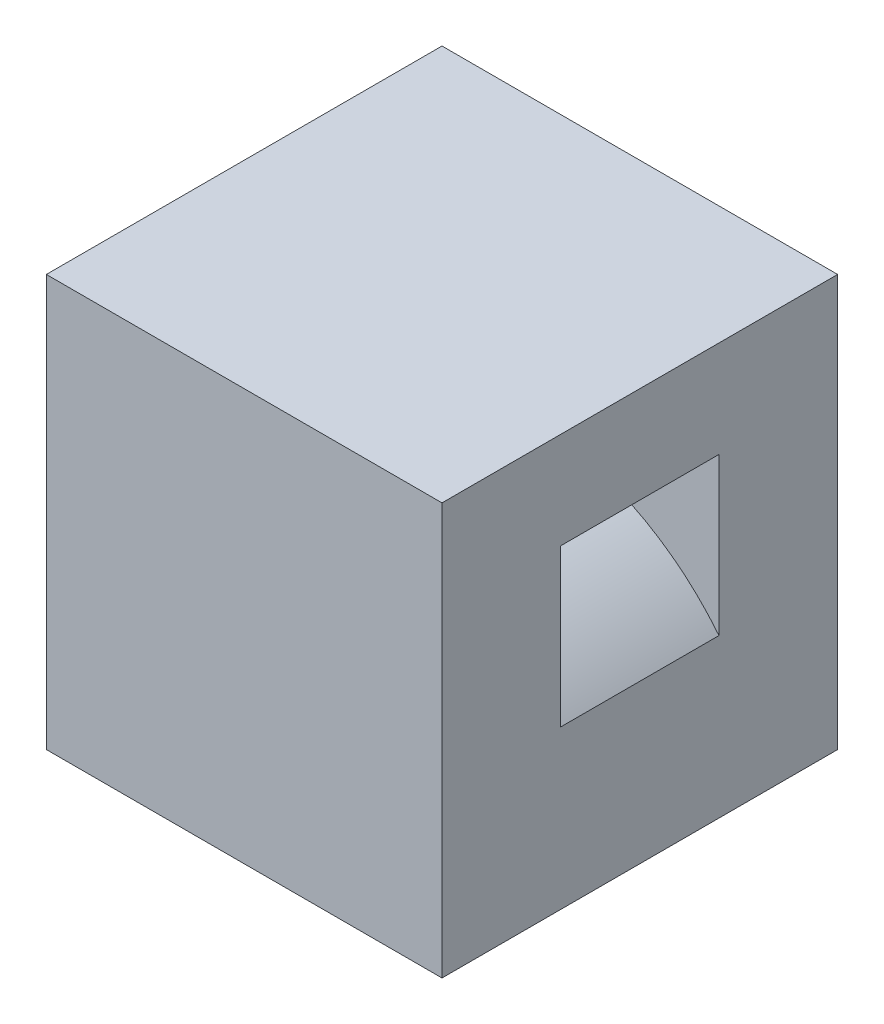
ISO-10303-21;
HEADER;
FILE_DESCRIPTION(('STEP AP214'),'2;1');
FILE_NAME('part.step','',(''),(''),'','','');
FILE_SCHEMA(('AUTOMOTIVE_DESIGN { 1 0 10303 214 1 1 1 1 }'));
ENDSEC;
DATA;
#1=APPLICATION_CONTEXT('core data for automotive mechanical design processes');
#2=APPLICATION_PROTOCOL_DEFINITION('international standard','automotive_design',2000,#1);
#3=PRODUCT_CONTEXT('',#1,'mechanical');
#4=PRODUCT('Part','Part','',(#3));
#5=PRODUCT_RELATED_PRODUCT_CATEGORY('part','',(#4));
#6=PRODUCT_DEFINITION_FORMATION('','',#4);
#7=PRODUCT_DEFINITION_CONTEXT('part definition',#1,'design');
#8=PRODUCT_DEFINITION('design','',#6,#7);
#9=PRODUCT_DEFINITION_SHAPE('','',#8);
#10=(LENGTH_UNIT() NAMED_UNIT(*) SI_UNIT(.MILLI.,.METRE.));
#11=(NAMED_UNIT(*) PLANE_ANGLE_UNIT() SI_UNIT($,.RADIAN.));
#12=(NAMED_UNIT(*) SI_UNIT($,.STERADIAN.) SOLID_ANGLE_UNIT());
#13=UNCERTAINTY_MEASURE_WITH_UNIT(LENGTH_MEASURE(1.E-05),#10,'distance_accuracy_value','');
#14=(GEOMETRIC_REPRESENTATION_CONTEXT(3) GLOBAL_UNCERTAINTY_ASSIGNED_CONTEXT((#13)) GLOBAL_UNIT_ASSIGNED_CONTEXT((#10,
#11,#12)) REPRESENTATION_CONTEXT('',''));
#15=CARTESIAN_POINT('',(0.,0.,0.));
#16=DIRECTION('',(0.,0.,1.));
#17=DIRECTION('',(1.,0.,0.));
#18=AXIS2_PLACEMENT_3D('',#15,#16,#17);
#19=CARTESIAN_POINT('',(-15.875,-16.51,31.75));
#20=DIRECTION('',(0.,1.,0.));
#21=DIRECTION('',(0.,0.,1.));
#22=AXIS2_PLACEMENT_3D('',#19,#20,#21);
#23=PLANE('',#22);
#24=DIRECTION('',(0.,0.,-1.));
#25=VECTOR('',#24,1.);
#26=CARTESIAN_POINT('',(-12.7,-16.51,28.575));
#27=LINE('',#26,#25);
#28=CARTESIAN_POINT('',(-12.7,-16.51,28.575));
#29=VERTEX_POINT('',#28);
#30=CARTESIAN_POINT('',(-12.7,-16.51,3.175));
#31=VERTEX_POINT('',#30);
#32=EDGE_CURVE('E181',#29,#31,#27,.T.);
#33=ORIENTED_EDGE('',*,*,#32,.F.);
#34=DIRECTION('',(1.,0.,0.));
#35=VECTOR('',#34,1.);
#36=CARTESIAN_POINT('',(0.,-16.51,28.575));
#37=LINE('',#36,#35);
#38=CARTESIAN_POINT('',(12.7,-16.51,28.575));
#39=VERTEX_POINT('',#38);
#40=EDGE_CURVE('E166',#29,#39,#37,.T.);
#41=ORIENTED_EDGE('',*,*,#40,.T.);
#42=DIRECTION('',(0.,0.,-1.));
#43=VECTOR('',#42,1.);
#44=CARTESIAN_POINT('',(12.7,-16.51,28.575));
#45=LINE('',#44,#43);
#46=CARTESIAN_POINT('',(12.7,-16.51,3.175));
#47=VERTEX_POINT('',#46);
#48=EDGE_CURVE('E202',#39,#47,#45,.T.);
#49=ORIENTED_EDGE('',*,*,#48,.T.);
#50=DIRECTION('',(1.,0.,0.));
#51=VECTOR('',#50,1.);
#52=CARTESIAN_POINT('',(0.,-16.51,3.175));
#53=LINE('',#52,#51);
#54=EDGE_CURVE('E155',#31,#47,#53,.T.);
#55=ORIENTED_EDGE('',*,*,#54,.F.);
#56=EDGE_LOOP('',(#33,#41,#49,#55));
#57=FACE_BOUND('',#56,.T.);
#58=DIRECTION('',(1.,0.,0.));
#59=VECTOR('',#58,1.);
#60=CARTESIAN_POINT('',(-15.875,-16.51,0.));
#61=LINE('',#60,#59);
#62=CARTESIAN_POINT('',(-15.875,-16.51,0.));
#63=VERTEX_POINT('',#62);
#64=CARTESIAN_POINT('',(15.875,-16.51,0.));
#65=VERTEX_POINT('',#64);
#66=EDGE_CURVE('E206',#63,#65,#61,.T.);
#67=ORIENTED_EDGE('',*,*,#66,.T.);
#68=DIRECTION('',(0.,0.,-1.));
#69=VECTOR('',#68,1.);
#70=CARTESIAN_POINT('',(15.875,-16.51,31.75));
#71=LINE('',#70,#69);
#72=CARTESIAN_POINT('',(15.875,-16.51,31.75));
#73=VERTEX_POINT('',#72);
#74=EDGE_CURVE('E11',#73,#65,#71,.T.);
#75=ORIENTED_EDGE('',*,*,#74,.F.);
#76=DIRECTION('',(1.,0.,0.));
#77=VECTOR('',#76,1.);
#78=CARTESIAN_POINT('',(-15.875,-16.51,31.75));
#79=LINE('',#78,#77);
#80=CARTESIAN_POINT('',(-15.875,-16.51,31.75));
#81=VERTEX_POINT('',#80);
#82=EDGE_CURVE('E207',#81,#73,#79,.T.);
#83=ORIENTED_EDGE('',*,*,#82,.F.);
#84=DIRECTION('',(0.,0.,-1.));
#85=VECTOR('',#84,1.);
#86=CARTESIAN_POINT('',(-15.875,-16.51,31.75));
#87=LINE('',#86,#85);
#88=EDGE_CURVE('E223',#81,#63,#87,.T.);
#89=ORIENTED_EDGE('',*,*,#88,.T.);
#90=EDGE_LOOP('',(#67,#75,#83,#89));
#91=FACE_BOUND('',#90,.T.);
#92=ADVANCED_FACE('F39',(#57,#91),#23,.F.);
#93=CARTESIAN_POINT('',(15.875,-16.51,31.75));
#94=DIRECTION('',(-1.,0.,0.));
#95=DIRECTION('',(0.,-1.,0.));
#96=AXIS2_PLACEMENT_3D('',#93,#94,#95);
#97=PLANE('',#96);
#98=DIRECTION('',(0.,0.,-1.));
#99=VECTOR('',#98,1.);
#100=CARTESIAN_POINT('',(15.875,-3.82588493429675,22.225));
#101=LINE('',#100,#99);
#102=CARTESIAN_POINT('',(15.875,-3.82588493429675,22.225));
#103=VERTEX_POINT('',#102);
#104=CARTESIAN_POINT('',(15.875,-3.82588493429675,9.525));
#105=VERTEX_POINT('',#104);
#106=EDGE_CURVE('E54',#103,#105,#101,.T.);
#107=ORIENTED_EDGE('',*,*,#106,.F.);
#108=DIRECTION('',(0.,1.,0.));
#109=VECTOR('',#108,1.);
#110=CARTESIAN_POINT('',(15.875,0.,22.225));
#111=LINE('',#110,#109);
#112=CARTESIAN_POINT('',(15.875,8.76268090250814,22.225));
#113=VERTEX_POINT('',#112);
#114=EDGE_CURVE('E412',#103,#113,#111,.T.);
#115=ORIENTED_EDGE('',*,*,#114,.T.);
#116=DIRECTION('',(0.,0.,-1.));
#117=VECTOR('',#116,1.);
#118=CARTESIAN_POINT('',(15.875,8.76268090250814,22.225));
#119=LINE('',#118,#117);
#120=CARTESIAN_POINT('',(15.875,8.76268090250814,9.525));
#121=VERTEX_POINT('',#120);
#122=EDGE_CURVE('E135',#113,#121,#119,.T.);
#123=ORIENTED_EDGE('',*,*,#122,.T.);
#124=DIRECTION('',(0.,1.,0.));
#125=VECTOR('',#124,1.);
#126=CARTESIAN_POINT('',(15.875,0.,9.525));
#127=LINE('',#126,#125);
#128=EDGE_CURVE('E141',#105,#121,#127,.T.);
#129=ORIENTED_EDGE('',*,*,#128,.F.);
#130=EDGE_LOOP('',(#107,#115,#123,#129));
#131=FACE_BOUND('',#130,.T.);
#132=DIRECTION('',(0.,1.,0.));
#133=VECTOR('',#132,1.);
#134=CARTESIAN_POINT('',(15.875,-16.51,0.));
#135=LINE('',#134,#133);
#136=CARTESIAN_POINT('',(15.875,16.51,0.));
#137=VERTEX_POINT('',#136);
#138=EDGE_CURVE('E227',#65,#137,#135,.T.);
#139=ORIENTED_EDGE('',*,*,#138,.T.);
#140=DIRECTION('',(0.,0.,-1.));
#141=VECTOR('',#140,1.);
#142=CARTESIAN_POINT('',(15.875,16.51,31.75));
#143=LINE('',#142,#141);
#144=CARTESIAN_POINT('',(15.875,16.51,31.75));
#145=VERTEX_POINT('',#144);
#146=EDGE_CURVE('E47',#145,#137,#143,.T.);
#147=ORIENTED_EDGE('',*,*,#146,.F.);
#148=DIRECTION('',(0.,1.,0.));
#149=VECTOR('',#148,1.);
#150=CARTESIAN_POINT('',(15.875,-16.51,31.75));
#151=LINE('',#150,#149);
#152=EDGE_CURVE('E211',#73,#145,#151,.T.);
#153=ORIENTED_EDGE('',*,*,#152,.F.);
#154=ORIENTED_EDGE('',*,*,#74,.T.);
#155=EDGE_LOOP('',(#139,#147,#153,#154));
#156=FACE_BOUND('',#155,.T.);
#157=ADVANCED_FACE('F249',(#131,#156),#97,.F.);
#158=CARTESIAN_POINT('',(-15.875,16.51,31.75));
#159=DIRECTION('',(0.,1.,0.));
#160=DIRECTION('',(0.,0.,1.));
#161=AXIS2_PLACEMENT_3D('',#158,#159,#160);
#162=PLANE('',#161);
#163=DIRECTION('',(1.,0.,0.));
#164=VECTOR('',#163,1.);
#165=CARTESIAN_POINT('',(-15.875,16.51,0.));
#166=LINE('',#165,#164);
#167=CARTESIAN_POINT('',(-15.875,16.51,0.));
#168=VERTEX_POINT('',#167);
#169=EDGE_CURVE('E231',#168,#137,#166,.T.);
#170=ORIENTED_EDGE('',*,*,#169,.F.);
#171=DIRECTION('',(0.,0.,-1.));
#172=VECTOR('',#171,1.);
#173=CARTESIAN_POINT('',(-15.875,16.51,31.75));
#174=LINE('',#173,#172);
#175=CARTESIAN_POINT('',(-15.875,16.51,31.75));
#176=VERTEX_POINT('',#175);
#177=EDGE_CURVE('E240',#176,#168,#174,.T.);
#178=ORIENTED_EDGE('',*,*,#177,.F.);
#179=DIRECTION('',(1.,0.,0.));
#180=VECTOR('',#179,1.);
#181=CARTESIAN_POINT('',(-15.875,16.51,31.75));
#182=LINE('',#181,#180);
#183=EDGE_CURVE('E215',#176,#145,#182,.T.);
#184=ORIENTED_EDGE('',*,*,#183,.T.);
#185=ORIENTED_EDGE('',*,*,#146,.T.);
#186=EDGE_LOOP('',(#170,#178,#184,#185));
#187=FACE_BOUND('',#186,.T.);
#188=ADVANCED_FACE('F246',(#187),#162,.T.);
#189=CARTESIAN_POINT('',(-15.875,-16.51,31.75));
#190=DIRECTION('',(-1.,0.,0.));
#191=DIRECTION('',(0.,-1.,0.));
#192=AXIS2_PLACEMENT_3D('',#189,#190,#191);
#193=PLANE('',#192);
#194=DIRECTION('',(0.,1.,0.));
#195=VECTOR('',#194,1.);
#196=CARTESIAN_POINT('',(-15.875,0.,22.225));
#197=LINE('',#196,#195);
#198=CARTESIAN_POINT('',(-15.875,-3.82588493429675,22.225));
#199=VERTEX_POINT('',#198);
#200=CARTESIAN_POINT('',(-15.875,8.76268090250814,22.225));
#201=VERTEX_POINT('',#200);
#202=EDGE_CURVE('E140',#199,#201,#197,.T.);
#203=ORIENTED_EDGE('',*,*,#202,.F.);
#204=DIRECTION('',(0.,0.,-1.));
#205=VECTOR('',#204,1.);
#206=CARTESIAN_POINT('',(-15.875,-3.82588493429675,22.225));
#207=LINE('',#206,#205);
#208=CARTESIAN_POINT('',(-15.875,-3.82588493429675,9.525));
#209=VERTEX_POINT('',#208);
#210=EDGE_CURVE('E156',#199,#209,#207,.T.);
#211=ORIENTED_EDGE('',*,*,#210,.T.);
#212=DIRECTION('',(0.,1.,0.));
#213=VECTOR('',#212,1.);
#214=CARTESIAN_POINT('',(-15.875,0.,9.525));
#215=LINE('',#214,#213);
#216=CARTESIAN_POINT('',(-15.875,8.76268090250814,9.525));
#217=VERTEX_POINT('',#216);
#218=EDGE_CURVE('E153',#209,#217,#215,.T.);
#219=ORIENTED_EDGE('',*,*,#218,.T.);
#220=DIRECTION('',(0.,0.,-1.));
#221=VECTOR('',#220,1.);
#222=CARTESIAN_POINT('',(-15.875,8.76268090250814,22.225));
#223=LINE('',#222,#221);
#224=EDGE_CURVE('E132',#201,#217,#223,.T.);
#225=ORIENTED_EDGE('',*,*,#224,.F.);
#226=EDGE_LOOP('',(#203,#211,#219,#225));
#227=FACE_BOUND('',#226,.T.);
#228=DIRECTION('',(0.,1.,0.));
#229=VECTOR('',#228,1.);
#230=CARTESIAN_POINT('',(-15.875,-16.51,0.));
#231=LINE('',#230,#229);
#232=EDGE_CURVE('E212',#63,#168,#231,.T.);
#233=ORIENTED_EDGE('',*,*,#232,.F.);
#234=ORIENTED_EDGE('',*,*,#88,.F.);
#235=DIRECTION('',(0.,1.,0.));
#236=VECTOR('',#235,1.);
#237=CARTESIAN_POINT('',(-15.875,-16.51,31.75));
#238=LINE('',#237,#236);
#239=EDGE_CURVE('E219',#81,#176,#238,.T.);
#240=ORIENTED_EDGE('',*,*,#239,.T.);
#241=ORIENTED_EDGE('',*,*,#177,.T.);
#242=EDGE_LOOP('',(#233,#234,#240,#241));
#243=FACE_BOUND('',#242,.T.);
#244=ADVANCED_FACE('F151',(#227,#243),#193,.T.);
#245=CARTESIAN_POINT('',(0.,0.,31.75));
#246=DIRECTION('',(0.,0.,1.));
#247=DIRECTION('',(1.,0.,0.));
#248=AXIS2_PLACEMENT_3D('',#245,#246,#247);
#249=PLANE('',#248);
#250=ORIENTED_EDGE('',*,*,#82,.T.);
#251=ORIENTED_EDGE('',*,*,#152,.T.);
#252=ORIENTED_EDGE('',*,*,#183,.F.);
#253=ORIENTED_EDGE('',*,*,#239,.F.);
#254=EDGE_LOOP('',(#250,#251,#252,#253));
#255=FACE_BOUND('',#254,.T.);
#256=ADVANCED_FACE('F258',(#255),#249,.T.);
#257=CARTESIAN_POINT('',(0.,0.,0.));
#258=DIRECTION('',(0.,0.,1.));
#259=DIRECTION('',(1.,0.,0.));
#260=AXIS2_PLACEMENT_3D('',#257,#258,#259);
#261=PLANE('',#260);
#262=ORIENTED_EDGE('',*,*,#66,.F.);
#263=ORIENTED_EDGE('',*,*,#232,.T.);
#264=ORIENTED_EDGE('',*,*,#169,.T.);
#265=ORIENTED_EDGE('',*,*,#138,.F.);
#266=EDGE_LOOP('',(#262,#263,#264,#265));
#267=FACE_BOUND('',#266,.T.);
#268=ADVANCED_FACE('F253',(#267),#261,.F.);
#269=CARTESIAN_POINT('',(12.7,0.,28.575));
#270=DIRECTION('',(-1.,0.,0.));
#271=DIRECTION('',(0.,-1.,0.));
#272=AXIS2_PLACEMENT_3D('',#269,#270,#271);
#273=PLANE('',#272);
#274=DIRECTION('',(0.,1.,0.));
#275=VECTOR('',#274,1.);
#276=CARTESIAN_POINT('',(12.7,0.,3.175));
#277=LINE('',#276,#275);
#278=CARTESIAN_POINT('',(12.7,-3.81,3.175));
#279=VERTEX_POINT('',#278);
#280=EDGE_CURVE('E161',#47,#279,#277,.T.);
#281=ORIENTED_EDGE('',*,*,#280,.F.);
#282=ORIENTED_EDGE('',*,*,#48,.F.);
#283=DIRECTION('',(0.,1.,0.));
#284=VECTOR('',#283,1.);
#285=CARTESIAN_POINT('',(12.7,0.,28.575));
#286=LINE('',#285,#284);
#287=CARTESIAN_POINT('',(12.7,-3.81,28.575));
#288=VERTEX_POINT('',#287);
#289=EDGE_CURVE('E170',#39,#288,#286,.T.);
#290=ORIENTED_EDGE('',*,*,#289,.T.);
#291=DIRECTION('',(0.,0.,-1.));
#292=VECTOR('',#291,1.);
#293=CARTESIAN_POINT('',(12.7,-3.81,28.575));
#294=LINE('',#293,#292);
#295=EDGE_CURVE('E199',#288,#279,#294,.T.);
#296=ORIENTED_EDGE('',*,*,#295,.T.);
#297=EDGE_LOOP('',(#281,#282,#290,#296));
#298=FACE_BOUND('',#297,.T.);
#299=ADVANCED_FACE('F277',(#298),#273,.T.);
#300=CARTESIAN_POINT('',(0.,-3.81,28.575));
#301=DIRECTION('',(0.,1.,0.));
#302=DIRECTION('',(-1.,0.,0.));
#303=AXIS2_PLACEMENT_3D('',#300,#301,#302);
#304=PLANE('',#303);
#305=DIRECTION('',(1.,0.,0.));
#306=VECTOR('',#305,1.);
#307=CARTESIAN_POINT('',(0.,-3.81,3.175));
#308=LINE('',#307,#306);
#309=CARTESIAN_POINT('',(-12.7,-3.81,3.175));
#310=VERTEX_POINT('',#309);
#311=EDGE_CURVE('E186',#310,#279,#308,.T.);
#312=ORIENTED_EDGE('',*,*,#311,.T.);
#313=ORIENTED_EDGE('',*,*,#295,.F.);
#314=DIRECTION('',(1.,0.,0.));
#315=VECTOR('',#314,1.);
#316=CARTESIAN_POINT('',(0.,-3.81,28.575));
#317=LINE('',#316,#315);
#318=CARTESIAN_POINT('',(-12.7,-3.81,28.575));
#319=VERTEX_POINT('',#318);
#320=EDGE_CURVE('E174',#319,#288,#317,.T.);
#321=ORIENTED_EDGE('',*,*,#320,.F.);
#322=DIRECTION('',(0.,0.,-1.));
#323=VECTOR('',#322,1.);
#324=CARTESIAN_POINT('',(-12.7,-3.81,28.575));
#325=LINE('',#324,#323);
#326=EDGE_CURVE('E196',#319,#310,#325,.T.);
#327=ORIENTED_EDGE('',*,*,#326,.T.);
#328=EDGE_LOOP('',(#312,#313,#321,#327));
#329=FACE_BOUND('',#328,.T.);
#330=ADVANCED_FACE('F282',(#329),#304,.F.);
#331=CARTESIAN_POINT('',(-12.7,0.,28.575));
#332=DIRECTION('',(-1.,0.,0.));
#333=DIRECTION('',(0.,-1.,0.));
#334=AXIS2_PLACEMENT_3D('',#331,#332,#333);
#335=PLANE('',#334);
#336=DIRECTION('',(0.,1.,0.));
#337=VECTOR('',#336,1.);
#338=CARTESIAN_POINT('',(-12.7,0.,3.175));
#339=LINE('',#338,#337);
#340=EDGE_CURVE('E171',#31,#310,#339,.T.);
#341=ORIENTED_EDGE('',*,*,#340,.T.);
#342=ORIENTED_EDGE('',*,*,#326,.F.);
#343=DIRECTION('',(0.,1.,0.));
#344=VECTOR('',#343,1.);
#345=CARTESIAN_POINT('',(-12.7,0.,28.575));
#346=LINE('',#345,#344);
#347=EDGE_CURVE('E178',#29,#319,#346,.T.);
#348=ORIENTED_EDGE('',*,*,#347,.F.);
#349=ORIENTED_EDGE('',*,*,#32,.T.);
#350=EDGE_LOOP('',(#341,#342,#348,#349));
#351=FACE_BOUND('',#350,.T.);
#352=ADVANCED_FACE('F270',(#351),#335,.F.);
#353=CARTESIAN_POINT('',(0.,0.,28.575));
#354=DIRECTION('',(0.,0.,1.));
#355=DIRECTION('',(1.,0.,0.));
#356=AXIS2_PLACEMENT_3D('',#353,#354,#355);
#357=PLANE('',#356);
#358=ORIENTED_EDGE('',*,*,#40,.F.);
#359=ORIENTED_EDGE('',*,*,#347,.T.);
#360=ORIENTED_EDGE('',*,*,#320,.T.);
#361=ORIENTED_EDGE('',*,*,#289,.F.);
#362=EDGE_LOOP('',(#358,#359,#360,#361));
#363=FACE_BOUND('',#362,.T.);
#364=ADVANCED_FACE('F273',(#363),#357,.F.);
#365=CARTESIAN_POINT('',(0.,0.,3.175));
#366=DIRECTION('',(0.,0.,1.));
#367=DIRECTION('',(1.,0.,0.));
#368=AXIS2_PLACEMENT_3D('',#365,#366,#367);
#369=PLANE('',#368);
#370=ORIENTED_EDGE('',*,*,#54,.T.);
#371=ORIENTED_EDGE('',*,*,#280,.T.);
#372=ORIENTED_EDGE('',*,*,#311,.F.);
#373=ORIENTED_EDGE('',*,*,#340,.F.);
#374=EDGE_LOOP('',(#370,#371,#372,#373));
#375=FACE_BOUND('',#374,.T.);
#376=ADVANCED_FACE('F280',(#375),#369,.T.);
#377=CARTESIAN_POINT('',(0.,-16.51,22.225));
#378=DIRECTION('',(0.,0.,-1.));
#379=DIRECTION('',(-1.,0.,0.));
#380=AXIS2_PLACEMENT_3D('',#377,#378,#379);
#381=CYLINDRICAL_SURFACE('',#380,29.845);
#382=CARTESIAN_POINT('',(0.,-16.51,9.525));
#383=DIRECTION('',(0.,0.,1.));
#384=DIRECTION('',(1.,0.,0.));
#385=AXIS2_PLACEMENT_3D('',#382,#383,#384);
#386=CIRCLE('',#385,29.845);
#387=EDGE_CURVE('E62',#217,#121,#386,.F.);
#388=ORIENTED_EDGE('',*,*,#387,.T.);
#389=ORIENTED_EDGE('',*,*,#122,.F.);
#390=CARTESIAN_POINT('',(0.,-16.51,22.225));
#391=DIRECTION('',(0.,0.,1.));
#392=DIRECTION('',(1.,0.,0.));
#393=AXIS2_PLACEMENT_3D('',#390,#391,#392);
#394=CIRCLE('',#393,29.845);
#395=EDGE_CURVE('E128',#201,#113,#394,.F.);
#396=ORIENTED_EDGE('',*,*,#395,.F.);
#397=ORIENTED_EDGE('',*,*,#224,.T.);
#398=EDGE_LOOP('',(#388,#389,#396,#397));
#399=FACE_BOUND('',#398,.T.);
#400=ADVANCED_FACE('F130',(#399),#381,.F.);
#401=CARTESIAN_POINT('',(0.,-16.51,22.225));
#402=DIRECTION('',(0.,0.,-1.));
#403=DIRECTION('',(-1.,0.,0.));
#404=AXIS2_PLACEMENT_3D('',#401,#402,#403);
#405=CYLINDRICAL_SURFACE('',#404,20.32);
#406=CARTESIAN_POINT('',(0.,-16.51,9.525));
#407=DIRECTION('',(0.,0.,1.));
#408=DIRECTION('',(1.,0.,0.));
#409=AXIS2_PLACEMENT_3D('',#406,#407,#408);
#410=CIRCLE('',#409,20.32);
#411=EDGE_CURVE('E399',#209,#105,#410,.F.);
#412=ORIENTED_EDGE('',*,*,#411,.F.);
#413=ORIENTED_EDGE('',*,*,#210,.F.);
#414=CARTESIAN_POINT('',(0.,-16.51,22.225));
#415=DIRECTION('',(0.,0.,1.));
#416=DIRECTION('',(1.,0.,0.));
#417=AXIS2_PLACEMENT_3D('',#414,#415,#416);
#418=CIRCLE('',#417,20.32);
#419=EDGE_CURVE('E146',#199,#103,#418,.F.);
#420=ORIENTED_EDGE('',*,*,#419,.T.);
#421=ORIENTED_EDGE('',*,*,#106,.T.);
#422=EDGE_LOOP('',(#412,#413,#420,#421));
#423=FACE_BOUND('',#422,.T.);
#424=ADVANCED_FACE('F370',(#423),#405,.T.);
#425=CARTESIAN_POINT('',(0.,0.,22.225));
#426=DIRECTION('',(0.,0.,1.));
#427=DIRECTION('',(1.,0.,0.));
#428=AXIS2_PLACEMENT_3D('',#425,#426,#427);
#429=PLANE('',#428);
#430=ORIENTED_EDGE('',*,*,#395,.T.);
#431=ORIENTED_EDGE('',*,*,#114,.F.);
#432=ORIENTED_EDGE('',*,*,#419,.F.);
#433=ORIENTED_EDGE('',*,*,#202,.T.);
#434=EDGE_LOOP('',(#430,#431,#432,#433));
#435=FACE_BOUND('',#434,.T.);
#436=ADVANCED_FACE('F145',(#435),#429,.F.);
#437=CARTESIAN_POINT('',(0.,0.,9.525));
#438=DIRECTION('',(0.,0.,1.));
#439=DIRECTION('',(1.,0.,0.));
#440=AXIS2_PLACEMENT_3D('',#437,#438,#439);
#441=PLANE('',#440);
#442=ORIENTED_EDGE('',*,*,#387,.F.);
#443=ORIENTED_EDGE('',*,*,#218,.F.);
#444=ORIENTED_EDGE('',*,*,#411,.T.);
#445=ORIENTED_EDGE('',*,*,#128,.T.);
#446=EDGE_LOOP('',(#442,#443,#444,#445));
#447=FACE_BOUND('',#446,.T.);
#448=ADVANCED_FACE('F382',(#447),#441,.T.);
#449=CLOSED_SHELL('',(#92,#157,#188,#244,#256,#268,#299,#330,#352,#364,#376,#400,#424,#436,#448));
#450=MANIFOLD_SOLID_BREP('B2',#449);
#451=ADVANCED_BREP_SHAPE_REPRESENTATION('',(#18,#450),#14);
#452=SHAPE_DEFINITION_REPRESENTATION(#9,#451);
ENDSEC;
END-ISO-10303-21;
